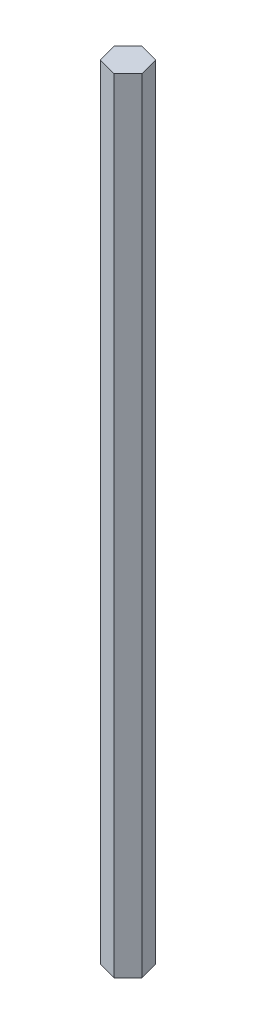
ISO-10303-21;
HEADER;
FILE_DESCRIPTION(('STEP AP214'),'2;1');
FILE_NAME('part.step','',(''),(''),'','','');
FILE_SCHEMA(('AUTOMOTIVE_DESIGN { 1 0 10303 214 1 1 1 1 }'));
ENDSEC;
DATA;
#1=APPLICATION_CONTEXT('core data for automotive mechanical design processes');
#2=APPLICATION_PROTOCOL_DEFINITION('international standard','automotive_design',2000,#1);
#3=PRODUCT_CONTEXT('',#1,'mechanical');
#4=PRODUCT('Part','Part','',(#3));
#5=PRODUCT_RELATED_PRODUCT_CATEGORY('part','',(#4));
#6=PRODUCT_DEFINITION_FORMATION('','',#4);
#7=PRODUCT_DEFINITION_CONTEXT('part definition',#1,'design');
#8=PRODUCT_DEFINITION('design','',#6,#7);
#9=PRODUCT_DEFINITION_SHAPE('','',#8);
#10=(LENGTH_UNIT() NAMED_UNIT(*) SI_UNIT(.MILLI.,.METRE.));
#11=(NAMED_UNIT(*) PLANE_ANGLE_UNIT() SI_UNIT($,.RADIAN.));
#12=(NAMED_UNIT(*) SI_UNIT($,.STERADIAN.) SOLID_ANGLE_UNIT());
#13=UNCERTAINTY_MEASURE_WITH_UNIT(LENGTH_MEASURE(1.E-05),#10,'distance_accuracy_value','');
#14=(GEOMETRIC_REPRESENTATION_CONTEXT(3) GLOBAL_UNCERTAINTY_ASSIGNED_CONTEXT((#13)) GLOBAL_UNIT_ASSIGNED_CONTEXT((#10,
#11,#12)) REPRESENTATION_CONTEXT('',''));
#15=CARTESIAN_POINT('',(0.,0.,0.));
#16=DIRECTION('',(0.,0.,1.));
#17=DIRECTION('',(1.,0.,0.));
#18=AXIS2_PLACEMENT_3D('',#15,#16,#17);
#19=CARTESIAN_POINT('',(6.74624,279.4,1.80764955994654));
#20=DIRECTION('',(-0.965925826289068,0.,0.25881904510252));
#21=DIRECTION('',(0.25881904510252,0.,0.965925826289068));
#22=AXIS2_PLACEMENT_3D('',#19,#20,#21);
#23=PLANE('',#22);
#24=DIRECTION('',(-0.25881904510252,0.,-0.965925826289068));
#25=VECTOR('',#24,1.);
#26=CARTESIAN_POINT('',(6.74624,0.,1.80764955994654));
#27=LINE('',#26,#25);
#28=CARTESIAN_POINT('',(6.74624,0.,1.80764955994654));
#29=VERTEX_POINT('',#28);
#30=CARTESIAN_POINT('',(4.93859044005346,0.,-4.93859044005346));
#31=VERTEX_POINT('',#30);
#32=EDGE_CURVE('E128',#29,#31,#27,.T.);
#33=ORIENTED_EDGE('',*,*,#32,.T.);
#34=DIRECTION('',(0.,-1.,0.));
#35=VECTOR('',#34,1.);
#36=CARTESIAN_POINT('',(4.93859044005346,279.4,-4.93859044005346));
#37=LINE('',#36,#35);
#38=CARTESIAN_POINT('',(4.93859044005346,279.4,-4.93859044005346));
#39=VERTEX_POINT('',#38);
#40=EDGE_CURVE('E11',#39,#31,#37,.T.);
#41=ORIENTED_EDGE('',*,*,#40,.F.);
#42=DIRECTION('',(-0.25881904510252,0.,-0.965925826289068));
#43=VECTOR('',#42,1.);
#44=CARTESIAN_POINT('',(6.74624,279.4,1.80764955994654));
#45=LINE('',#44,#43);
#46=CARTESIAN_POINT('',(6.74624,279.4,1.80764955994654));
#47=VERTEX_POINT('',#46);
#48=EDGE_CURVE('E144',#47,#39,#45,.T.);
#49=ORIENTED_EDGE('',*,*,#48,.F.);
#50=DIRECTION('',(0.,-1.,0.));
#51=VECTOR('',#50,1.);
#52=CARTESIAN_POINT('',(6.74624,279.4,1.80764955994654));
#53=LINE('',#52,#51);
#54=EDGE_CURVE('E124',#47,#29,#53,.T.);
#55=ORIENTED_EDGE('',*,*,#54,.T.);
#56=EDGE_LOOP('',(#33,#41,#49,#55));
#57=FACE_BOUND('',#56,.T.);
#58=ADVANCED_FACE('F39',(#57),#23,.F.);
#59=CARTESIAN_POINT('',(4.93859044005346,279.4,-4.93859044005346));
#60=DIRECTION('',(-0.258819045102521,0.,0.965925826289068));
#61=DIRECTION('',(0.965925826289068,0.,0.258819045102521));
#62=AXIS2_PLACEMENT_3D('',#59,#60,#61);
#63=PLANE('',#62);
#64=DIRECTION('',(-0.965925826289068,0.,-0.258819045102521));
#65=VECTOR('',#64,1.);
#66=CARTESIAN_POINT('',(4.93859044005346,0.,-4.93859044005346));
#67=LINE('',#66,#65);
#68=CARTESIAN_POINT('',(-1.80764955994654,0.,-6.74624));
#69=VERTEX_POINT('',#68);
#70=EDGE_CURVE('E132',#31,#69,#67,.T.);
#71=ORIENTED_EDGE('',*,*,#70,.T.);
#72=DIRECTION('',(0.,-1.,0.));
#73=VECTOR('',#72,1.);
#74=CARTESIAN_POINT('',(-1.80764955994654,279.4,-6.74624));
#75=LINE('',#74,#73);
#76=CARTESIAN_POINT('',(-1.80764955994654,279.4,-6.74624));
#77=VERTEX_POINT('',#76);
#78=EDGE_CURVE('E48',#77,#69,#75,.T.);
#79=ORIENTED_EDGE('',*,*,#78,.F.);
#80=DIRECTION('',(-0.965925826289068,0.,-0.258819045102521));
#81=VECTOR('',#80,1.);
#82=CARTESIAN_POINT('',(4.93859044005346,279.4,-4.93859044005346));
#83=LINE('',#82,#81);
#84=EDGE_CURVE('E93',#39,#77,#83,.T.);
#85=ORIENTED_EDGE('',*,*,#84,.F.);
#86=ORIENTED_EDGE('',*,*,#40,.T.);
#87=EDGE_LOOP('',(#71,#79,#85,#86));
#88=FACE_BOUND('',#87,.T.);
#89=ADVANCED_FACE('F172',(#88),#63,.F.);
#90=CARTESIAN_POINT('',(-1.80764955994654,279.4,-6.74624));
#91=DIRECTION('',(0.707106781186546,0.,0.707106781186549));
#92=DIRECTION('',(0.707106781186549,0.,-0.707106781186546));
#93=AXIS2_PLACEMENT_3D('',#90,#91,#92);
#94=PLANE('',#93);
#95=DIRECTION('',(-0.707106781186549,0.,0.707106781186546));
#96=VECTOR('',#95,1.);
#97=CARTESIAN_POINT('',(-1.80764955994654,0.,-6.74624));
#98=LINE('',#97,#96);
#99=CARTESIAN_POINT('',(-6.74624000000001,0.,-1.80764955994654));
#100=VERTEX_POINT('',#99);
#101=EDGE_CURVE('E135',#69,#100,#98,.T.);
#102=ORIENTED_EDGE('',*,*,#101,.T.);
#103=DIRECTION('',(0.,-1.,0.));
#104=VECTOR('',#103,1.);
#105=CARTESIAN_POINT('',(-6.74624000000001,279.4,-1.80764955994654));
#106=LINE('',#105,#104);
#107=CARTESIAN_POINT('',(-6.74624000000001,279.4,-1.80764955994654));
#108=VERTEX_POINT('',#107);
#109=EDGE_CURVE('E117',#108,#100,#106,.T.);
#110=ORIENTED_EDGE('',*,*,#109,.F.);
#111=DIRECTION('',(-0.707106781186549,0.,0.707106781186546));
#112=VECTOR('',#111,1.);
#113=CARTESIAN_POINT('',(-1.80764955994654,279.4,-6.74624));
#114=LINE('',#113,#112);
#115=EDGE_CURVE('E106',#77,#108,#114,.T.);
#116=ORIENTED_EDGE('',*,*,#115,.F.);
#117=ORIENTED_EDGE('',*,*,#78,.T.);
#118=EDGE_LOOP('',(#102,#110,#116,#117));
#119=FACE_BOUND('',#118,.T.);
#120=ADVANCED_FACE('F154',(#119),#94,.F.);
#121=CARTESIAN_POINT('',(-6.74624000000001,279.4,-1.80764955994654));
#122=DIRECTION('',(0.965925826289068,0.,-0.25881904510252));
#123=DIRECTION('',(-0.25881904510252,0.,-0.965925826289068));
#124=AXIS2_PLACEMENT_3D('',#121,#122,#123);
#125=PLANE('',#124);
#126=DIRECTION('',(0.25881904510252,0.,0.965925826289068));
#127=VECTOR('',#126,1.);
#128=CARTESIAN_POINT('',(-6.74624000000001,0.,-1.80764955994654));
#129=LINE('',#128,#127);
#130=CARTESIAN_POINT('',(-4.93859044005348,0.,4.93859044005346));
#131=VERTEX_POINT('',#130);
#132=EDGE_CURVE('E115',#100,#131,#129,.T.);
#133=ORIENTED_EDGE('',*,*,#132,.T.);
#134=DIRECTION('',(0.,-1.,0.));
#135=VECTOR('',#134,1.);
#136=CARTESIAN_POINT('',(-4.93859044005348,279.4,4.93859044005346));
#137=LINE('',#136,#135);
#138=CARTESIAN_POINT('',(-4.93859044005348,279.4,4.93859044005346));
#139=VERTEX_POINT('',#138);
#140=EDGE_CURVE('E112',#139,#131,#137,.T.);
#141=ORIENTED_EDGE('',*,*,#140,.F.);
#142=DIRECTION('',(0.25881904510252,0.,0.965925826289068));
#143=VECTOR('',#142,1.);
#144=CARTESIAN_POINT('',(-6.74624000000001,279.4,-1.80764955994654));
#145=LINE('',#144,#143);
#146=EDGE_CURVE('E100',#108,#139,#145,.T.);
#147=ORIENTED_EDGE('',*,*,#146,.F.);
#148=ORIENTED_EDGE('',*,*,#109,.T.);
#149=EDGE_LOOP('',(#133,#141,#147,#148));
#150=FACE_BOUND('',#149,.T.);
#151=ADVANCED_FACE('F113',(#150),#125,.F.);
#152=CARTESIAN_POINT('',(-4.93859044005348,279.4,4.93859044005346));
#153=DIRECTION('',(0.258819045102521,0.,-0.965925826289068));
#154=DIRECTION('',(-0.965925826289068,0.,-0.258819045102521));
#155=AXIS2_PLACEMENT_3D('',#152,#153,#154);
#156=PLANE('',#155);
#157=DIRECTION('',(0.965925826289068,0.,0.258819045102521));
#158=VECTOR('',#157,1.);
#159=CARTESIAN_POINT('',(-4.93859044005348,0.,4.93859044005346));
#160=LINE('',#159,#158);
#161=CARTESIAN_POINT('',(1.80764955994654,0.,6.74624000000001));
#162=VERTEX_POINT('',#161);
#163=EDGE_CURVE('E79',#131,#162,#160,.T.);
#164=ORIENTED_EDGE('',*,*,#163,.T.);
#165=DIRECTION('',(0.,-1.,0.));
#166=VECTOR('',#165,1.);
#167=CARTESIAN_POINT('',(1.80764955994654,279.4,6.74624000000001));
#168=LINE('',#167,#166);
#169=CARTESIAN_POINT('',(1.80764955994654,279.4,6.74624000000001));
#170=VERTEX_POINT('',#169);
#171=EDGE_CURVE('E118',#170,#162,#168,.T.);
#172=ORIENTED_EDGE('',*,*,#171,.F.);
#173=DIRECTION('',(0.965925826289068,0.,0.258819045102521));
#174=VECTOR('',#173,1.);
#175=CARTESIAN_POINT('',(-4.93859044005348,279.4,4.93859044005346));
#176=LINE('',#175,#174);
#177=EDGE_CURVE('E104',#139,#170,#176,.T.);
#178=ORIENTED_EDGE('',*,*,#177,.F.);
#179=ORIENTED_EDGE('',*,*,#140,.T.);
#180=EDGE_LOOP('',(#164,#172,#178,#179));
#181=FACE_BOUND('',#180,.T.);
#182=ADVANCED_FACE('F120',(#181),#156,.F.);
#183=CARTESIAN_POINT('',(1.80764955994654,279.4,6.74624000000001));
#184=DIRECTION('',(-0.707106781186548,0.,-0.707106781186547));
#185=DIRECTION('',(-0.707106781186547,0.,0.707106781186548));
#186=AXIS2_PLACEMENT_3D('',#183,#184,#185);
#187=PLANE('',#186);
#188=DIRECTION('',(0.707106781186547,0.,-0.707106781186548));
#189=VECTOR('',#188,1.);
#190=CARTESIAN_POINT('',(1.80764955994654,0.,6.74624000000001));
#191=LINE('',#190,#189);
#192=EDGE_CURVE('E85',#162,#29,#191,.T.);
#193=ORIENTED_EDGE('',*,*,#192,.T.);
#194=ORIENTED_EDGE('',*,*,#54,.F.);
#195=DIRECTION('',(0.707106781186547,0.,-0.707106781186548));
#196=VECTOR('',#195,1.);
#197=CARTESIAN_POINT('',(1.80764955994654,279.4,6.74624000000001));
#198=LINE('',#197,#196);
#199=EDGE_CURVE('E56',#170,#47,#198,.T.);
#200=ORIENTED_EDGE('',*,*,#199,.F.);
#201=ORIENTED_EDGE('',*,*,#171,.T.);
#202=EDGE_LOOP('',(#193,#194,#200,#201));
#203=FACE_BOUND('',#202,.T.);
#204=ADVANCED_FACE('F161',(#203),#187,.F.);
#205=CARTESIAN_POINT('',(0.,279.4,0.));
#206=DIRECTION('',(0.,1.,0.));
#207=DIRECTION('',(0.,0.,1.));
#208=AXIS2_PLACEMENT_3D('',#205,#206,#207);
#209=PLANE('',#208);
#210=ORIENTED_EDGE('',*,*,#48,.T.);
#211=ORIENTED_EDGE('',*,*,#84,.T.);
#212=ORIENTED_EDGE('',*,*,#115,.T.);
#213=ORIENTED_EDGE('',*,*,#146,.T.);
#214=ORIENTED_EDGE('',*,*,#177,.T.);
#215=ORIENTED_EDGE('',*,*,#199,.T.);
#216=EDGE_LOOP('',(#210,#211,#212,#213,#214,#215));
#217=FACE_BOUND('',#216,.T.);
#218=ADVANCED_FACE('F102',(#217),#209,.T.);
#219=CARTESIAN_POINT('',(0.,0.,0.));
#220=DIRECTION('',(0.,1.,0.));
#221=DIRECTION('',(0.,0.,1.));
#222=AXIS2_PLACEMENT_3D('',#219,#220,#221);
#223=PLANE('',#222);
#224=ORIENTED_EDGE('',*,*,#32,.F.);
#225=ORIENTED_EDGE('',*,*,#192,.F.);
#226=ORIENTED_EDGE('',*,*,#163,.F.);
#227=ORIENTED_EDGE('',*,*,#132,.F.);
#228=ORIENTED_EDGE('',*,*,#101,.F.);
#229=ORIENTED_EDGE('',*,*,#70,.F.);
#230=EDGE_LOOP('',(#224,#225,#226,#227,#228,#229));
#231=FACE_BOUND('',#230,.T.);
#232=ADVANCED_FACE('F157',(#231),#223,.F.);
#233=CLOSED_SHELL('',(#58,#89,#120,#151,#182,#204,#218,#232));
#234=MANIFOLD_SOLID_BREP('B2',#233);
#235=ADVANCED_BREP_SHAPE_REPRESENTATION('',(#18,#234),#14);
#236=SHAPE_DEFINITION_REPRESENTATION(#9,#235);
ENDSEC;
END-ISO-10303-21;
